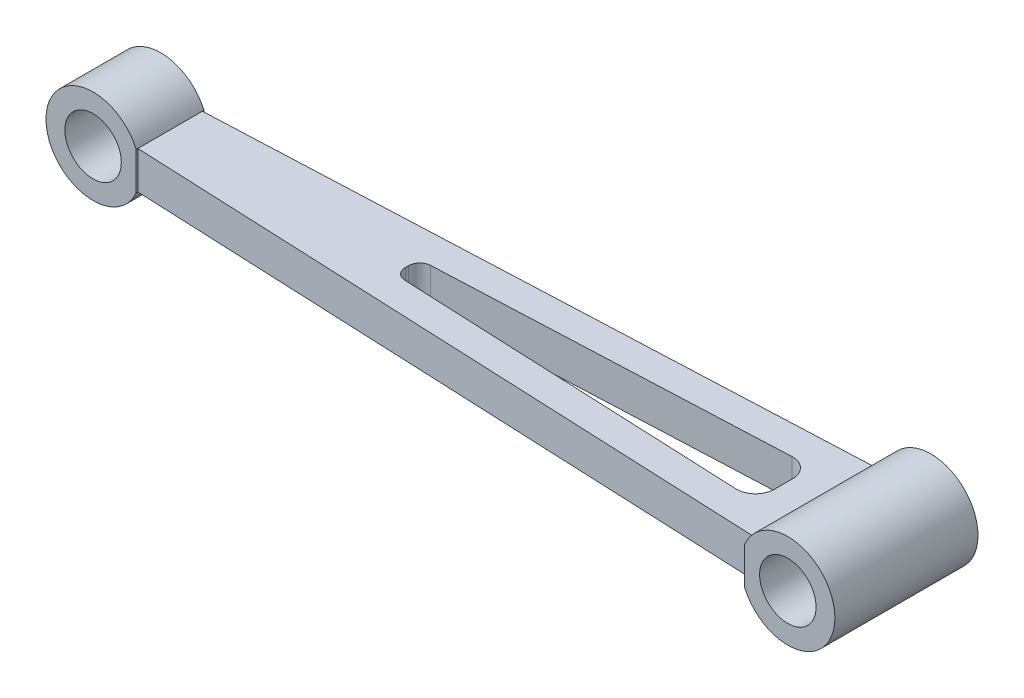
ISO-10303-21;
HEADER;
FILE_DESCRIPTION(('STEP AP214'),'2;1');
FILE_NAME('part.step','',(''),(''),'','','');
FILE_SCHEMA(('AUTOMOTIVE_DESIGN { 1 0 10303 214 1 1 1 1 }'));
ENDSEC;
DATA;
#1=APPLICATION_CONTEXT('core data for automotive mechanical design processes');
#2=APPLICATION_PROTOCOL_DEFINITION('international standard','automotive_design',2000,#1);
#3=PRODUCT_CONTEXT('',#1,'mechanical');
#4=PRODUCT('Part','Part','',(#3));
#5=PRODUCT_RELATED_PRODUCT_CATEGORY('part','',(#4));
#6=PRODUCT_DEFINITION_FORMATION('','',#4);
#7=PRODUCT_DEFINITION_CONTEXT('part definition',#1,'design');
#8=PRODUCT_DEFINITION('design','',#6,#7);
#9=PRODUCT_DEFINITION_SHAPE('','',#8);
#10=(LENGTH_UNIT() NAMED_UNIT(*) SI_UNIT(.MILLI.,.METRE.));
#11=(NAMED_UNIT(*) PLANE_ANGLE_UNIT() SI_UNIT($,.RADIAN.));
#12=(NAMED_UNIT(*) SI_UNIT($,.STERADIAN.) SOLID_ANGLE_UNIT());
#13=UNCERTAINTY_MEASURE_WITH_UNIT(LENGTH_MEASURE(1.E-05),#10,'distance_accuracy_value','');
#14=(GEOMETRIC_REPRESENTATION_CONTEXT(3) GLOBAL_UNCERTAINTY_ASSIGNED_CONTEXT((#13)) GLOBAL_UNIT_ASSIGNED_CONTEXT((#10,
#11,#12)) REPRESENTATION_CONTEXT('',''));
#15=CARTESIAN_POINT('',(0.,0.,0.));
#16=DIRECTION('',(0.,0.,1.));
#17=DIRECTION('',(1.,0.,0.));
#18=AXIS2_PLACEMENT_3D('',#15,#16,#17);
#19=CARTESIAN_POINT('',(0.,0.,38.));
#20=DIRECTION('',(0.,0.,-1.));
#21=DIRECTION('',(-1.,0.,0.));
#22=AXIS2_PLACEMENT_3D('',#19,#20,#21);
#23=CYLINDRICAL_SURFACE('',#22,12.5);
#24=CARTESIAN_POINT('',(0.,0.,28.));
#25=DIRECTION('',(0.,0.,1.));
#26=DIRECTION('',(1.,0.,0.));
#27=AXIS2_PLACEMENT_3D('',#24,#25,#26);
#28=CIRCLE('',#27,12.5);
#29=CARTESIAN_POINT('',(11.4564392373896,5.,28.));
#30=VERTEX_POINT('',#29);
#31=CARTESIAN_POINT('',(11.4564392373896,-5.,28.));
#32=VERTEX_POINT('',#31);
#33=EDGE_CURVE('E226',#30,#32,#28,.T.);
#34=ORIENTED_EDGE('',*,*,#33,.F.);
#35=DIRECTION('',(0.,0.,-1.));
#36=VECTOR('',#35,1.);
#37=CARTESIAN_POINT('',(11.4564392373896,5.,38.));
#38=LINE('',#37,#36);
#39=CARTESIAN_POINT('',(11.4564392373896,5.,27.5581520756621));
#40=VERTEX_POINT('',#39);
#41=EDGE_CURVE('E204',#30,#40,#38,.T.);
#42=ORIENTED_EDGE('',*,*,#41,.T.);
#43=CARTESIAN_POINT('',(11.4564392373896,5.,10.4418479243379));
#44=VERTEX_POINT('',#43);
#45=EDGE_CURVE('E203',#40,#44,#38,.T.);
#46=ORIENTED_EDGE('',*,*,#45,.T.);
#47=CARTESIAN_POINT('',(11.4564392373896,5.,10.));
#48=VERTEX_POINT('',#47);
#49=EDGE_CURVE('E199',#44,#48,#38,.T.);
#50=ORIENTED_EDGE('',*,*,#49,.T.);
#51=CARTESIAN_POINT('',(0.,0.,10.));
#52=DIRECTION('',(0.,0.,1.));
#53=DIRECTION('',(1.,0.,0.));
#54=AXIS2_PLACEMENT_3D('',#51,#52,#53);
#55=CIRCLE('',#54,12.5);
#56=CARTESIAN_POINT('',(11.4564392373896,-5.,10.));
#57=VERTEX_POINT('',#56);
#58=EDGE_CURVE('E221',#48,#57,#55,.T.);
#59=ORIENTED_EDGE('',*,*,#58,.T.);
#60=DIRECTION('',(0.,0.,1.));
#61=VECTOR('',#60,1.);
#62=CARTESIAN_POINT('',(11.4564392373896,-5.,38.));
#63=LINE('',#62,#61);
#64=CARTESIAN_POINT('',(11.4564392373896,-5.,10.4418479243379));
#65=VERTEX_POINT('',#64);
#66=EDGE_CURVE('E316',#57,#65,#63,.T.);
#67=ORIENTED_EDGE('',*,*,#66,.T.);
#68=DIRECTION('',(0.,0.,-1.));
#69=VECTOR('',#68,1.);
#70=CARTESIAN_POINT('',(11.4564392373896,-5.,38.));
#71=LINE('',#70,#69);
#72=CARTESIAN_POINT('',(11.4564392373896,-5.,27.5581520756621));
#73=VERTEX_POINT('',#72);
#74=EDGE_CURVE('E170',#73,#65,#71,.T.);
#75=ORIENTED_EDGE('',*,*,#74,.F.);
#76=DIRECTION('',(0.,0.,1.));
#77=VECTOR('',#76,1.);
#78=CARTESIAN_POINT('',(11.4564392373896,-5.,38.));
#79=LINE('',#78,#77);
#80=EDGE_CURVE('E193',#73,#32,#79,.T.);
#81=ORIENTED_EDGE('',*,*,#80,.T.);
#82=EDGE_LOOP('',(#34,#42,#46,#50,#59,#67,#75,#81));
#83=FACE_BOUND('',#82,.T.);
#84=ADVANCED_FACE('F44',(#83),#23,.T.);
#85=CARTESIAN_POINT('',(0.,-5.,38.));
#86=DIRECTION('',(0.,1.,0.));
#87=DIRECTION('',(0.,0.,1.));
#88=AXIS2_PLACEMENT_3D('',#85,#86,#87);
#89=PLANE('',#88);
#90=DIRECTION('',(0.999048221581858,0.,-0.0436193873653361));
#91=VECTOR('',#90,1.);
#92=CARTESIAN_POINT('',(-0.830172902485017,-5.,18.9859144768226));
#93=LINE('',#92,#91);
#94=CARTESIAN_POINT('',(77.2209222192092,-5.,15.5781300687674));
#95=VERTEX_POINT('',#94);
#96=CARTESIAN_POINT('',(169.133683444479,-5.,11.5651322483472));
#97=VERTEX_POINT('',#96);
#98=EDGE_CURVE('E307',#95,#97,#93,.T.);
#99=ORIENTED_EDGE('',*,*,#98,.F.);
#100=CARTESIAN_POINT('',(77.3517803813052,-5.,18.575274733513));
#101=DIRECTION('',(0.,1.,0.));
#102=DIRECTION('',(0.,0.,1.));
#103=AXIS2_PLACEMENT_3D('',#100,#101,#102);
#104=CIRCLE('',#103,3.);
#105=CARTESIAN_POINT('',(74.3517803813052,-5.,18.575274733513));
#106=VERTEX_POINT('',#105);
#107=EDGE_CURVE('E272',#95,#106,#104,.T.);
#108=ORIENTED_EDGE('',*,*,#107,.T.);
#109=DIRECTION('',(0.,0.,1.));
#110=VECTOR('',#109,1.);
#111=CARTESIAN_POINT('',(74.351780381305,-5.,38.0000000000006));
#112=LINE('',#111,#110);
#113=CARTESIAN_POINT('',(74.3517803813052,-5.,19.424725266487));
#114=VERTEX_POINT('',#113);
#115=EDGE_CURVE('E310',#106,#114,#112,.T.);
#116=ORIENTED_EDGE('',*,*,#115,.T.);
#117=CARTESIAN_POINT('',(77.3517803813052,-5.,19.424725266487));
#118=DIRECTION('',(0.,1.,0.));
#119=DIRECTION('',(0.,0.,1.));
#120=AXIS2_PLACEMENT_3D('',#117,#118,#119);
#121=CIRCLE('',#120,3.);
#122=CARTESIAN_POINT('',(77.2209222192092,-5.,22.4218699312326));
#123=VERTEX_POINT('',#122);
#124=EDGE_CURVE('E266',#114,#123,#121,.T.);
#125=ORIENTED_EDGE('',*,*,#124,.T.);
#126=DIRECTION('',(0.999048221581858,0.,0.0436193873653361));
#127=VECTOR('',#126,1.);
#128=CARTESIAN_POINT('',(0.825786209720492,-5.,19.0863862594343));
#129=LINE('',#128,#127);
#130=CARTESIAN_POINT('',(169.133683444479,-5.,26.4348677516528));
#131=VERTEX_POINT('',#130);
#132=EDGE_CURVE('E318',#123,#131,#129,.T.);
#133=ORIENTED_EDGE('',*,*,#132,.T.);
#134=CARTESIAN_POINT('',(169.351780381305,-5.,21.4396266437435));
#135=DIRECTION('',(0.,1.,0.));
#136=DIRECTION('',(0.,0.,1.));
#137=AXIS2_PLACEMENT_3D('',#134,#135,#136);
#138=CIRCLE('',#137,5.);
#139=CARTESIAN_POINT('',(174.351780381305,-5.,21.4396266437435));
#140=VERTEX_POINT('',#139);
#141=EDGE_CURVE('E291',#131,#140,#138,.T.);
#142=ORIENTED_EDGE('',*,*,#141,.T.);
#143=DIRECTION('',(0.,0.,1.));
#144=VECTOR('',#143,1.);
#145=CARTESIAN_POINT('',(174.351780381305,-5.,38.0000000000013));
#146=LINE('',#145,#144);
#147=CARTESIAN_POINT('',(174.351780381305,-5.,16.5603733562565));
#148=VERTEX_POINT('',#147);
#149=EDGE_CURVE('E311',#148,#140,#146,.T.);
#150=ORIENTED_EDGE('',*,*,#149,.F.);
#151=CARTESIAN_POINT('',(169.351780381305,-5.,16.5603733562565));
#152=DIRECTION('',(0.,1.,0.));
#153=DIRECTION('',(0.,0.,1.));
#154=AXIS2_PLACEMENT_3D('',#151,#152,#153);
#155=CIRCLE('',#154,5.);
#156=EDGE_CURVE('E11',#148,#97,#155,.T.);
#157=ORIENTED_EDGE('',*,*,#156,.T.);
#158=EDGE_LOOP('',(#99,#108,#116,#125,#133,#142,#150,#157));
#159=FACE_BOUND('',#158,.T.);
#160=DIRECTION('',(0.999048221581858,0.,0.0436193873653361));
#161=VECTOR('',#160,1.);
#162=CARTESIAN_POINT('',(0.476831110797803,-5.,27.0787720320891));
#163=LINE('',#162,#161);
#164=CARTESIAN_POINT('',(183.04356076261,-5.00000000000003,35.0498075924107));
#165=VERTEX_POINT('',#164);
#166=EDGE_CURVE('E186',#73,#165,#163,.T.);
#167=ORIENTED_EDGE('',*,*,#166,.F.);
#168=ORIENTED_EDGE('',*,*,#74,.T.);
#169=DIRECTION('',(0.999048221581858,0.,-0.0436193873653361));
#170=VECTOR('',#169,1.);
#171=CARTESIAN_POINT('',(-1.17912800140771,-5.,10.9935287041677));
#172=LINE('',#171,#170);
#173=CARTESIAN_POINT('',(183.04356076261,-5.00000000000003,2.9501924075893));
#174=VERTEX_POINT('',#173);
#175=EDGE_CURVE('E325',#65,#174,#172,.T.);
#176=ORIENTED_EDGE('',*,*,#175,.T.);
#177=DIRECTION('',(0.,0.,-1.));
#178=VECTOR('',#177,1.);
#179=CARTESIAN_POINT('',(183.04356076261,-5.,38.));
#180=LINE('',#179,#178);
#181=EDGE_CURVE('E178',#165,#174,#180,.T.);
#182=ORIENTED_EDGE('',*,*,#181,.F.);
#183=EDGE_LOOP('',(#167,#168,#176,#182));
#184=FACE_BOUND('',#183,.T.);
#185=ADVANCED_FACE('F361',(#159,#184),#89,.F.);
#186=CARTESIAN_POINT('',(0.,5.,38.));
#187=DIRECTION('',(0.,1.,0.));
#188=DIRECTION('',(0.,0.,1.));
#189=AXIS2_PLACEMENT_3D('',#186,#187,#188);
#190=PLANE('',#189);
#191=DIRECTION('',(0.,0.,1.));
#192=VECTOR('',#191,1.);
#193=CARTESIAN_POINT('',(74.351780381305,5.,38.0000000000006));
#194=LINE('',#193,#192);
#195=CARTESIAN_POINT('',(74.3517803813052,5.,18.575274733513));
#196=VERTEX_POINT('',#195);
#197=CARTESIAN_POINT('',(74.3517803813052,5.,19.424725266487));
#198=VERTEX_POINT('',#197);
#199=EDGE_CURVE('E238',#196,#198,#194,.T.);
#200=ORIENTED_EDGE('',*,*,#199,.F.);
#201=CARTESIAN_POINT('',(77.3517803813052,5.,18.575274733513));
#202=DIRECTION('',(0.,1.,0.));
#203=DIRECTION('',(0.,0.,1.));
#204=AXIS2_PLACEMENT_3D('',#201,#202,#203);
#205=CIRCLE('',#204,3.);
#206=CARTESIAN_POINT('',(77.2209222192092,5.,15.5781300687674));
#207=VERTEX_POINT('',#206);
#208=EDGE_CURVE('E269',#196,#207,#205,.F.);
#209=ORIENTED_EDGE('',*,*,#208,.T.);
#210=DIRECTION('',(0.999048221581858,0.,-0.0436193873653361));
#211=VECTOR('',#210,1.);
#212=CARTESIAN_POINT('',(-0.830172902485017,5.,18.9859144768226));
#213=LINE('',#212,#211);
#214=CARTESIAN_POINT('',(169.133683444479,5.,11.5651322483472));
#215=VERTEX_POINT('',#214);
#216=EDGE_CURVE('E234',#207,#215,#213,.T.);
#217=ORIENTED_EDGE('',*,*,#216,.T.);
#218=CARTESIAN_POINT('',(169.351780381305,5.,16.5603733562565));
#219=DIRECTION('',(0.,1.,0.));
#220=DIRECTION('',(0.,0.,1.));
#221=AXIS2_PLACEMENT_3D('',#218,#219,#220);
#222=CIRCLE('',#221,5.);
#223=CARTESIAN_POINT('',(174.351780381305,5.,16.5603733562565));
#224=VERTEX_POINT('',#223);
#225=EDGE_CURVE('E53',#215,#224,#222,.F.);
#226=ORIENTED_EDGE('',*,*,#225,.T.);
#227=DIRECTION('',(0.,0.,1.));
#228=VECTOR('',#227,1.);
#229=CARTESIAN_POINT('',(174.351780381305,5.,38.0000000000013));
#230=LINE('',#229,#228);
#231=CARTESIAN_POINT('',(174.351780381305,5.,21.4396266437435));
#232=VERTEX_POINT('',#231);
#233=EDGE_CURVE('E230',#224,#232,#230,.T.);
#234=ORIENTED_EDGE('',*,*,#233,.T.);
#235=CARTESIAN_POINT('',(169.351780381305,5.,21.4396266437435));
#236=DIRECTION('',(0.,1.,0.));
#237=DIRECTION('',(0.,0.,1.));
#238=AXIS2_PLACEMENT_3D('',#235,#236,#237);
#239=CIRCLE('',#238,5.);
#240=CARTESIAN_POINT('',(169.133683444479,5.,26.4348677516528));
#241=VERTEX_POINT('',#240);
#242=EDGE_CURVE('E288',#232,#241,#239,.F.);
#243=ORIENTED_EDGE('',*,*,#242,.T.);
#244=DIRECTION('',(0.999048221581858,0.,0.0436193873653361));
#245=VECTOR('',#244,1.);
#246=CARTESIAN_POINT('',(0.825786209720492,5.,19.0863862594343));
#247=LINE('',#246,#245);
#248=CARTESIAN_POINT('',(77.2209222192092,5.,22.4218699312326));
#249=VERTEX_POINT('',#248);
#250=EDGE_CURVE('E217',#249,#241,#247,.T.);
#251=ORIENTED_EDGE('',*,*,#250,.F.);
#252=CARTESIAN_POINT('',(77.3517803813052,5.,19.424725266487));
#253=DIRECTION('',(0.,1.,0.));
#254=DIRECTION('',(0.,0.,1.));
#255=AXIS2_PLACEMENT_3D('',#252,#253,#254);
#256=CIRCLE('',#255,3.);
#257=EDGE_CURVE('E263',#249,#198,#256,.F.);
#258=ORIENTED_EDGE('',*,*,#257,.T.);
#259=EDGE_LOOP('',(#200,#209,#217,#226,#234,#243,#251,#258));
#260=FACE_BOUND('',#259,.T.);
#261=ORIENTED_EDGE('',*,*,#45,.F.);
#262=DIRECTION('',(0.999048221581858,0.,0.0436193873653361));
#263=VECTOR('',#262,1.);
#264=CARTESIAN_POINT('',(0.476831110797803,5.,27.0787720320891));
#265=LINE('',#264,#263);
#266=CARTESIAN_POINT('',(183.04356076261,5.,35.0498075924107));
#267=VERTEX_POINT('',#266);
#268=EDGE_CURVE('E245',#40,#267,#265,.T.);
#269=ORIENTED_EDGE('',*,*,#268,.T.);
#270=DIRECTION('',(0.,0.,-1.));
#271=VECTOR('',#270,1.);
#272=CARTESIAN_POINT('',(183.04356076261,5.,38.));
#273=LINE('',#272,#271);
#274=CARTESIAN_POINT('',(183.04356076261,5.,2.9501924075893));
#275=VERTEX_POINT('',#274);
#276=EDGE_CURVE('E208',#267,#275,#273,.T.);
#277=ORIENTED_EDGE('',*,*,#276,.T.);
#278=DIRECTION('',(0.999048221581858,0.,-0.0436193873653361));
#279=VECTOR('',#278,1.);
#280=CARTESIAN_POINT('',(-1.17912800140771,5.,10.9935287041677));
#281=LINE('',#280,#279);
#282=EDGE_CURVE('E242',#44,#275,#281,.T.);
#283=ORIENTED_EDGE('',*,*,#282,.F.);
#284=EDGE_LOOP('',(#261,#269,#277,#283));
#285=FACE_BOUND('',#284,.T.);
#286=ADVANCED_FACE('F297',(#260,#285),#190,.T.);
#287=CARTESIAN_POINT('',(194.5,0.,38.));
#288=DIRECTION('',(0.,0.,-1.));
#289=DIRECTION('',(-1.,0.,0.));
#290=AXIS2_PLACEMENT_3D('',#287,#288,#289);
#291=CYLINDRICAL_SURFACE('',#290,12.5);
#292=CARTESIAN_POINT('',(194.5,0.,0.));
#293=DIRECTION('',(0.,0.,1.));
#294=DIRECTION('',(1.,0.,0.));
#295=AXIS2_PLACEMENT_3D('',#292,#293,#294);
#296=CIRCLE('',#295,12.5);
#297=CARTESIAN_POINT('',(183.04356076261,-5.,0.));
#298=VERTEX_POINT('',#297);
#299=CARTESIAN_POINT('',(183.04356076261,5.,0.));
#300=VERTEX_POINT('',#299);
#301=EDGE_CURVE('E175',#298,#300,#296,.T.);
#302=ORIENTED_EDGE('',*,*,#301,.T.);
#303=DIRECTION('',(0.,0.,-1.));
#304=VECTOR('',#303,1.);
#305=CARTESIAN_POINT('',(183.04356076261,5.,38.));
#306=LINE('',#305,#304);
#307=EDGE_CURVE('E164',#275,#300,#306,.T.);
#308=ORIENTED_EDGE('',*,*,#307,.F.);
#309=ORIENTED_EDGE('',*,*,#276,.F.);
#310=CARTESIAN_POINT('',(183.04356076261,5.,38.));
#311=VERTEX_POINT('',#310);
#312=EDGE_CURVE('E205',#311,#267,#273,.T.);
#313=ORIENTED_EDGE('',*,*,#312,.F.);
#314=CARTESIAN_POINT('',(194.5,0.,38.));
#315=DIRECTION('',(0.,0.,1.));
#316=DIRECTION('',(1.,0.,0.));
#317=AXIS2_PLACEMENT_3D('',#314,#315,#316);
#318=CIRCLE('',#317,12.5);
#319=CARTESIAN_POINT('',(183.04356076261,-5.,38.));
#320=VERTEX_POINT('',#319);
#321=EDGE_CURVE('E191',#320,#311,#318,.T.);
#322=ORIENTED_EDGE('',*,*,#321,.F.);
#323=EDGE_CURVE('E209',#320,#165,#180,.T.);
#324=ORIENTED_EDGE('',*,*,#323,.T.);
#325=ORIENTED_EDGE('',*,*,#181,.T.);
#326=DIRECTION('',(0.,0.,-1.));
#327=VECTOR('',#326,1.);
#328=CARTESIAN_POINT('',(183.04356076261,-5.00000000000003,38.));
#329=LINE('',#328,#327);
#330=EDGE_CURVE('E161',#174,#298,#329,.T.);
#331=ORIENTED_EDGE('',*,*,#330,.T.);
#332=EDGE_LOOP('',(#302,#308,#309,#313,#322,#324,#325,#331));
#333=FACE_BOUND('',#332,.T.);
#334=ADVANCED_FACE('F174',(#333),#291,.T.);
#335=CARTESIAN_POINT('',(194.5,0.,38.));
#336=DIRECTION('',(0.,0.,-1.));
#337=DIRECTION('',(-1.,0.,0.));
#338=AXIS2_PLACEMENT_3D('',#335,#336,#337);
#339=CYLINDRICAL_SURFACE('',#338,7.50000000000001);
#340=CARTESIAN_POINT('',(194.5,0.,38.));
#341=DIRECTION('',(0.,0.,1.));
#342=DIRECTION('',(1.,0.,0.));
#343=AXIS2_PLACEMENT_3D('',#340,#341,#342);
#344=CIRCLE('',#343,7.50000000000001);
#345=CARTESIAN_POINT('',(202.,0.,38.));
#346=VERTEX_POINT('',#345);
#347=EDGE_CURVE('E196',#346,#346,#344,.F.);
#348=ORIENTED_EDGE('',*,*,#347,.F.);
#349=EDGE_LOOP('',(#348));
#350=FACE_BOUND('',#349,.T.);
#351=CARTESIAN_POINT('',(194.5,0.,0.));
#352=DIRECTION('',(0.,0.,1.));
#353=DIRECTION('',(1.,0.,0.));
#354=AXIS2_PLACEMENT_3D('',#351,#352,#353);
#355=CIRCLE('',#354,7.50000000000001);
#356=CARTESIAN_POINT('',(202.,0.,0.));
#357=VERTEX_POINT('',#356);
#358=EDGE_CURVE('E185',#357,#357,#355,.F.);
#359=ORIENTED_EDGE('',*,*,#358,.T.);
#360=EDGE_LOOP('',(#359));
#361=FACE_BOUND('',#360,.T.);
#362=ADVANCED_FACE('F343',(#350,#361),#339,.F.);
#363=CARTESIAN_POINT('',(0.,0.,38.));
#364=DIRECTION('',(0.,0.,1.));
#365=DIRECTION('',(1.,0.,0.));
#366=AXIS2_PLACEMENT_3D('',#363,#364,#365);
#367=PLANE('',#366);
#368=DIRECTION('',(0.,1.,0.));
#369=VECTOR('',#368,1.);
#370=CARTESIAN_POINT('',(183.04356076261,0.,38.));
#371=LINE('',#370,#369);
#372=EDGE_CURVE('E169',#320,#311,#371,.T.);
#373=ORIENTED_EDGE('',*,*,#372,.F.);
#374=ORIENTED_EDGE('',*,*,#321,.T.);
#375=EDGE_LOOP('',(#373,#374));
#376=FACE_BOUND('',#375,.T.);
#377=ORIENTED_EDGE('',*,*,#347,.T.);
#378=EDGE_LOOP('',(#377));
#379=FACE_BOUND('',#378,.T.);
#380=ADVANCED_FACE('F341',(#376,#379),#367,.T.);
#381=CARTESIAN_POINT('',(0.,0.,0.));
#382=DIRECTION('',(0.,0.,1.));
#383=DIRECTION('',(1.,0.,0.));
#384=AXIS2_PLACEMENT_3D('',#381,#382,#383);
#385=PLANE('',#384);
#386=ORIENTED_EDGE('',*,*,#301,.F.);
#387=DIRECTION('',(0.,1.,0.));
#388=VECTOR('',#387,1.);
#389=CARTESIAN_POINT('',(183.04356076261,0.,0.));
#390=LINE('',#389,#388);
#391=EDGE_CURVE('E157',#298,#300,#390,.T.);
#392=ORIENTED_EDGE('',*,*,#391,.T.);
#393=EDGE_LOOP('',(#386,#392));
#394=FACE_BOUND('',#393,.T.);
#395=ORIENTED_EDGE('',*,*,#358,.F.);
#396=EDGE_LOOP('',(#395));
#397=FACE_BOUND('',#396,.T.);
#398=ADVANCED_FACE('F182',(#394,#397),#385,.F.);
#399=CARTESIAN_POINT('',(0.476831110797802,-12.5,10.9212279679109));
#400=DIRECTION('',(0.0436193873653361,0.,0.999048221581858));
#401=DIRECTION('',(0.999048221581858,0.,-0.0436193873653361));
#402=AXIS2_PLACEMENT_3D('',#399,#400,#401);
#403=PLANE('',#402);
#404=DIRECTION('',(0.,1.,0.));
#405=VECTOR('',#404,1.);
#406=CARTESIAN_POINT('',(11.4564392373896,-12.5,10.4418479243379));
#407=LINE('',#406,#405);
#408=EDGE_CURVE('E414',#65,#44,#407,.T.);
#409=ORIENTED_EDGE('',*,*,#408,.T.);
#410=ORIENTED_EDGE('',*,*,#282,.T.);
#411=DIRECTION('',(0.,1.,0.));
#412=VECTOR('',#411,1.);
#413=CARTESIAN_POINT('',(183.04356076261,-12.5,2.9501924075893));
#414=LINE('',#413,#412);
#415=EDGE_CURVE('E418',#174,#275,#414,.T.);
#416=ORIENTED_EDGE('',*,*,#415,.F.);
#417=ORIENTED_EDGE('',*,*,#175,.F.);
#418=EDGE_LOOP('',(#409,#410,#416,#417));
#419=FACE_BOUND('',#418,.T.);
#420=ADVANCED_FACE('F349',(#419),#403,.F.);
#421=CARTESIAN_POINT('',(11.4564392373896,-12.5,0.));
#422=DIRECTION('',(-1.,0.,0.));
#423=DIRECTION('',(0.,0.,1.));
#424=AXIS2_PLACEMENT_3D('',#421,#422,#423);
#425=PLANE('',#424);
#426=DIRECTION('',(0.,1.,0.));
#427=VECTOR('',#426,1.);
#428=CARTESIAN_POINT('',(11.4564392373896,-12.5,10.));
#429=LINE('',#428,#427);
#430=EDGE_CURVE('E410',#57,#48,#429,.T.);
#431=ORIENTED_EDGE('',*,*,#430,.T.);
#432=ORIENTED_EDGE('',*,*,#49,.F.);
#433=ORIENTED_EDGE('',*,*,#408,.F.);
#434=ORIENTED_EDGE('',*,*,#66,.F.);
#435=EDGE_LOOP('',(#431,#432,#433,#434));
#436=FACE_BOUND('',#435,.T.);
#437=ADVANCED_FACE('F356',(#436),#425,.F.);
#438=CARTESIAN_POINT('',(0.,-12.5,10.));
#439=DIRECTION('',(0.,0.,1.));
#440=DIRECTION('',(1.,0.,0.));
#441=AXIS2_PLACEMENT_3D('',#438,#439,#440);
#442=PLANE('',#441);
#443=CARTESIAN_POINT('',(0.,0.,10.));
#444=DIRECTION('',(0.,0.,1.));
#445=DIRECTION('',(1.,0.,0.));
#446=AXIS2_PLACEMENT_3D('',#443,#444,#445);
#447=CIRCLE('',#446,7.5);
#448=CARTESIAN_POINT('',(7.5,0.,10.));
#449=VERTEX_POINT('',#448);
#450=EDGE_CURVE('E180',#449,#449,#447,.T.);
#451=ORIENTED_EDGE('',*,*,#450,.T.);
#452=EDGE_LOOP('',(#451));
#453=FACE_BOUND('',#452,.T.);
#454=ORIENTED_EDGE('',*,*,#430,.F.);
#455=ORIENTED_EDGE('',*,*,#58,.F.);
#456=EDGE_LOOP('',(#454,#455));
#457=FACE_BOUND('',#456,.T.);
#458=ADVANCED_FACE('F452',(#453,#457),#442,.F.);
#459=CARTESIAN_POINT('',(183.04356076261,-12.5,0.));
#460=DIRECTION('',(1.,0.,0.));
#461=DIRECTION('',(0.,0.,-1.));
#462=AXIS2_PLACEMENT_3D('',#459,#460,#461);
#463=PLANE('',#462);
#464=ORIENTED_EDGE('',*,*,#415,.T.);
#465=ORIENTED_EDGE('',*,*,#307,.T.);
#466=ORIENTED_EDGE('',*,*,#391,.F.);
#467=ORIENTED_EDGE('',*,*,#330,.F.);
#468=EDGE_LOOP('',(#464,#465,#466,#467));
#469=FACE_BOUND('',#468,.T.);
#470=ADVANCED_FACE('F160',(#469),#463,.F.);
#471=CARTESIAN_POINT('',(-1.17912800140771,-12.5,27.0064712958323));
#472=DIRECTION('',(-0.0436193873653361,0.,0.999048221581858));
#473=DIRECTION('',(0.999048221581858,0.,0.0436193873653361));
#474=AXIS2_PLACEMENT_3D('',#471,#472,#473);
#475=PLANE('',#474);
#476=ORIENTED_EDGE('',*,*,#166,.T.);
#477=DIRECTION('',(0.,1.,0.));
#478=VECTOR('',#477,1.);
#479=CARTESIAN_POINT('',(183.04356076261,-12.5,35.0498075924107));
#480=LINE('',#479,#478);
#481=EDGE_CURVE('E409',#165,#267,#480,.T.);
#482=ORIENTED_EDGE('',*,*,#481,.T.);
#483=ORIENTED_EDGE('',*,*,#268,.F.);
#484=DIRECTION('',(0.,1.,0.));
#485=VECTOR('',#484,1.);
#486=CARTESIAN_POINT('',(11.4564392373896,-12.5,27.5581520756621));
#487=LINE('',#486,#485);
#488=EDGE_CURVE('E421',#73,#40,#487,.T.);
#489=ORIENTED_EDGE('',*,*,#488,.F.);
#490=EDGE_LOOP('',(#476,#482,#483,#489));
#491=FACE_BOUND('',#490,.T.);
#492=ADVANCED_FACE('F433',(#491),#475,.T.);
#493=CARTESIAN_POINT('',(11.4564392373896,-12.5,0.));
#494=DIRECTION('',(-1.,0.,0.));
#495=DIRECTION('',(0.,0.,1.));
#496=AXIS2_PLACEMENT_3D('',#493,#494,#495);
#497=PLANE('',#496);
#498=ORIENTED_EDGE('',*,*,#488,.T.);
#499=ORIENTED_EDGE('',*,*,#41,.F.);
#500=DIRECTION('',(0.,1.,0.));
#501=VECTOR('',#500,1.);
#502=CARTESIAN_POINT('',(11.4564392373896,-12.5,28.));
#503=LINE('',#502,#501);
#504=EDGE_CURVE('E425',#32,#30,#503,.T.);
#505=ORIENTED_EDGE('',*,*,#504,.F.);
#506=ORIENTED_EDGE('',*,*,#80,.F.);
#507=EDGE_LOOP('',(#498,#499,#505,#506));
#508=FACE_BOUND('',#507,.T.);
#509=ADVANCED_FACE('F564',(#508),#497,.F.);
#510=CARTESIAN_POINT('',(0.,-12.5,28.));
#511=DIRECTION('',(0.,0.,1.));
#512=DIRECTION('',(1.,0.,0.));
#513=AXIS2_PLACEMENT_3D('',#510,#511,#512);
#514=PLANE('',#513);
#515=CARTESIAN_POINT('',(0.,0.,28.));
#516=DIRECTION('',(0.,0.,1.));
#517=DIRECTION('',(1.,0.,0.));
#518=AXIS2_PLACEMENT_3D('',#515,#516,#517);
#519=CIRCLE('',#518,7.5);
#520=CARTESIAN_POINT('',(7.5,0.,28.));
#521=VERTEX_POINT('',#520);
#522=EDGE_CURVE('E222',#521,#521,#519,.T.);
#523=ORIENTED_EDGE('',*,*,#522,.F.);
#524=EDGE_LOOP('',(#523));
#525=FACE_BOUND('',#524,.T.);
#526=ORIENTED_EDGE('',*,*,#33,.T.);
#527=ORIENTED_EDGE('',*,*,#504,.T.);
#528=EDGE_LOOP('',(#526,#527));
#529=FACE_BOUND('',#528,.T.);
#530=ADVANCED_FACE('F556',(#525,#529),#514,.T.);
#531=CARTESIAN_POINT('',(183.04356076261,-12.5,0.));
#532=DIRECTION('',(1.,0.,0.));
#533=DIRECTION('',(0.,0.,-1.));
#534=AXIS2_PLACEMENT_3D('',#531,#532,#533);
#535=PLANE('',#534);
#536=ORIENTED_EDGE('',*,*,#372,.T.);
#537=ORIENTED_EDGE('',*,*,#312,.T.);
#538=ORIENTED_EDGE('',*,*,#481,.F.);
#539=ORIENTED_EDGE('',*,*,#323,.F.);
#540=EDGE_LOOP('',(#536,#537,#538,#539));
#541=FACE_BOUND('',#540,.T.);
#542=ADVANCED_FACE('F377',(#541),#535,.F.);
#543=CARTESIAN_POINT('',(0.,0.,38.));
#544=DIRECTION('',(0.,0.,-1.));
#545=DIRECTION('',(-1.,0.,0.));
#546=AXIS2_PLACEMENT_3D('',#543,#544,#545);
#547=CYLINDRICAL_SURFACE('',#546,7.5);
#548=ORIENTED_EDGE('',*,*,#450,.F.);
#549=EDGE_LOOP('',(#548));
#550=FACE_BOUND('',#549,.T.);
#551=ORIENTED_EDGE('',*,*,#522,.T.);
#552=EDGE_LOOP('',(#551));
#553=FACE_BOUND('',#552,.T.);
#554=ADVANCED_FACE('F373',(#550,#553),#547,.F.);
#555=CARTESIAN_POINT('',(74.3517803813054,-12.5,6.26001381348626E-13));
#556=DIRECTION('',(-1.,0.,0.));
#557=DIRECTION('',(0.,0.,1.));
#558=AXIS2_PLACEMENT_3D('',#555,#556,#557);
#559=PLANE('',#558);
#560=ORIENTED_EDGE('',*,*,#199,.T.);
#561=DIRECTION('',(0.,1.,0.));
#562=VECTOR('',#561,1.);
#563=CARTESIAN_POINT('',(74.3517803813052,-5.,19.424725266487));
#564=LINE('',#563,#562);
#565=EDGE_CURVE('E257',#198,#114,#564,.F.);
#566=ORIENTED_EDGE('',*,*,#565,.T.);
#567=ORIENTED_EDGE('',*,*,#115,.F.);
#568=DIRECTION('',(0.,1.,0.));
#569=VECTOR('',#568,1.);
#570=CARTESIAN_POINT('',(74.3517803813052,-12.5,18.575274733513));
#571=LINE('',#570,#569);
#572=EDGE_CURVE('E253',#106,#196,#571,.T.);
#573=ORIENTED_EDGE('',*,*,#572,.T.);
#574=EDGE_LOOP('',(#560,#566,#567,#573));
#575=FACE_BOUND('',#574,.T.);
#576=ADVANCED_FACE('F376',(#575),#559,.F.);
#577=CARTESIAN_POINT('',(0.825786209720491,-12.5,18.9136137405657));
#578=DIRECTION('',(0.0436193873653361,0.,0.999048221581858));
#579=DIRECTION('',(0.999048221581858,0.,-0.0436193873653361));
#580=AXIS2_PLACEMENT_3D('',#577,#578,#579);
#581=PLANE('',#580);
#582=ORIENTED_EDGE('',*,*,#98,.T.);
#583=DIRECTION('',(0.,1.,0.));
#584=VECTOR('',#583,1.);
#585=CARTESIAN_POINT('',(169.133683444479,5.,11.5651322483472));
#586=LINE('',#585,#584);
#587=EDGE_CURVE('E285',#97,#215,#586,.T.);
#588=ORIENTED_EDGE('',*,*,#587,.T.);
#589=ORIENTED_EDGE('',*,*,#216,.F.);
#590=DIRECTION('',(0.,1.,0.));
#591=VECTOR('',#590,1.);
#592=CARTESIAN_POINT('',(77.2209222192092,-12.5,15.5781300687674));
#593=LINE('',#592,#591);
#594=EDGE_CURVE('E260',#207,#95,#593,.F.);
#595=ORIENTED_EDGE('',*,*,#594,.T.);
#596=EDGE_LOOP('',(#582,#588,#589,#595));
#597=FACE_BOUND('',#596,.T.);
#598=ADVANCED_FACE('F305',(#597),#581,.T.);
#599=CARTESIAN_POINT('',(174.351780381305,-12.5,1.26306323308936E-12));
#600=DIRECTION('',(-1.,0.,0.));
#601=DIRECTION('',(0.,0.,1.));
#602=AXIS2_PLACEMENT_3D('',#599,#600,#601);
#603=PLANE('',#602);
#604=ORIENTED_EDGE('',*,*,#149,.T.);
#605=DIRECTION('',(0.,1.,0.));
#606=VECTOR('',#605,1.);
#607=CARTESIAN_POINT('',(174.351780381305,-12.5,21.4396266437435));
#608=LINE('',#607,#606);
#609=EDGE_CURVE('E278',#140,#232,#608,.T.);
#610=ORIENTED_EDGE('',*,*,#609,.T.);
#611=ORIENTED_EDGE('',*,*,#233,.F.);
#612=DIRECTION('',(0.,1.,0.));
#613=VECTOR('',#612,1.);
#614=CARTESIAN_POINT('',(174.351780381305,-5.,16.5603733562565));
#615=LINE('',#614,#613);
#616=EDGE_CURVE('E275',#224,#148,#615,.F.);
#617=ORIENTED_EDGE('',*,*,#616,.T.);
#618=EDGE_LOOP('',(#604,#610,#611,#617));
#619=FACE_BOUND('',#618,.T.);
#620=ADVANCED_FACE('F302',(#619),#603,.T.);
#621=CARTESIAN_POINT('',(-0.830172902485018,-12.5,19.0140855231774));
#622=DIRECTION('',(-0.0436193873653361,0.,0.999048221581858));
#623=DIRECTION('',(0.999048221581858,0.,0.0436193873653361));
#624=AXIS2_PLACEMENT_3D('',#621,#622,#623);
#625=PLANE('',#624);
#626=ORIENTED_EDGE('',*,*,#250,.T.);
#627=DIRECTION('',(0.,1.,0.));
#628=VECTOR('',#627,1.);
#629=CARTESIAN_POINT('',(169.133683444478,-12.5,26.4348677516528));
#630=LINE('',#629,#628);
#631=EDGE_CURVE('E282',#241,#131,#630,.F.);
#632=ORIENTED_EDGE('',*,*,#631,.T.);
#633=ORIENTED_EDGE('',*,*,#132,.F.);
#634=DIRECTION('',(0.,1.,0.));
#635=VECTOR('',#634,1.);
#636=CARTESIAN_POINT('',(77.2209222192092,5.,22.4218699312326));
#637=LINE('',#636,#635);
#638=EDGE_CURVE('E249',#123,#249,#637,.T.);
#639=ORIENTED_EDGE('',*,*,#638,.T.);
#640=EDGE_LOOP('',(#626,#632,#633,#639));
#641=FACE_BOUND('',#640,.T.);
#642=ADVANCED_FACE('F383',(#641),#625,.F.);
#643=CARTESIAN_POINT('',(77.3517803813052,-12.5,19.424725266487));
#644=DIRECTION('',(0.,-1.,0.));
#645=DIRECTION('',(0.,0.,-1.));
#646=AXIS2_PLACEMENT_3D('',#643,#644,#645);
#647=CYLINDRICAL_SURFACE('',#646,3.);
#648=ORIENTED_EDGE('',*,*,#124,.F.);
#649=ORIENTED_EDGE('',*,*,#565,.F.);
#650=ORIENTED_EDGE('',*,*,#257,.F.);
#651=ORIENTED_EDGE('',*,*,#638,.F.);
#652=EDGE_LOOP('',(#648,#649,#650,#651));
#653=FACE_BOUND('',#652,.T.);
#654=ADVANCED_FACE('F379',(#653),#647,.F.);
#655=CARTESIAN_POINT('',(77.3517803813052,-12.5,18.575274733513));
#656=DIRECTION('',(0.,1.,0.));
#657=DIRECTION('',(0.,0.,1.));
#658=AXIS2_PLACEMENT_3D('',#655,#656,#657);
#659=CYLINDRICAL_SURFACE('',#658,3.);
#660=ORIENTED_EDGE('',*,*,#107,.F.);
#661=ORIENTED_EDGE('',*,*,#594,.F.);
#662=ORIENTED_EDGE('',*,*,#208,.F.);
#663=ORIENTED_EDGE('',*,*,#572,.F.);
#664=EDGE_LOOP('',(#660,#661,#662,#663));
#665=FACE_BOUND('',#664,.T.);
#666=ADVANCED_FACE('F382',(#665),#659,.F.);
#667=CARTESIAN_POINT('',(169.351780381305,-12.5,21.4396266437435));
#668=DIRECTION('',(0.,1.,0.));
#669=DIRECTION('',(0.,0.,1.));
#670=AXIS2_PLACEMENT_3D('',#667,#668,#669);
#671=CYLINDRICAL_SURFACE('',#670,5.);
#672=ORIENTED_EDGE('',*,*,#141,.F.);
#673=ORIENTED_EDGE('',*,*,#631,.F.);
#674=ORIENTED_EDGE('',*,*,#242,.F.);
#675=ORIENTED_EDGE('',*,*,#609,.F.);
#676=EDGE_LOOP('',(#672,#673,#674,#675));
#677=FACE_BOUND('',#676,.T.);
#678=ADVANCED_FACE('F386',(#677),#671,.F.);
#679=CARTESIAN_POINT('',(169.351780381305,-12.5,16.5603733562565));
#680=DIRECTION('',(0.,-1.,0.));
#681=DIRECTION('',(0.,0.,-1.));
#682=AXIS2_PLACEMENT_3D('',#679,#680,#681);
#683=CYLINDRICAL_SURFACE('',#682,5.);
#684=ORIENTED_EDGE('',*,*,#156,.F.);
#685=ORIENTED_EDGE('',*,*,#616,.F.);
#686=ORIENTED_EDGE('',*,*,#225,.F.);
#687=ORIENTED_EDGE('',*,*,#587,.F.);
#688=EDGE_LOOP('',(#684,#685,#686,#687));
#689=FACE_BOUND('',#688,.T.);
#690=ADVANCED_FACE('F46',(#689),#683,.F.);
#691=CLOSED_SHELL('',(#84,#185,#286,#334,#362,#380,#398,#420,#437,#458,#470,#492,#509,#530,#542,
#554,#576,#598,#620,#642,#654,#666,#678,#690));
#692=MANIFOLD_SOLID_BREP('B2',#691);
#693=ADVANCED_BREP_SHAPE_REPRESENTATION('',(#18,#692),#14);
#694=SHAPE_DEFINITION_REPRESENTATION(#9,#693);
ENDSEC;
END-ISO-10303-21;
